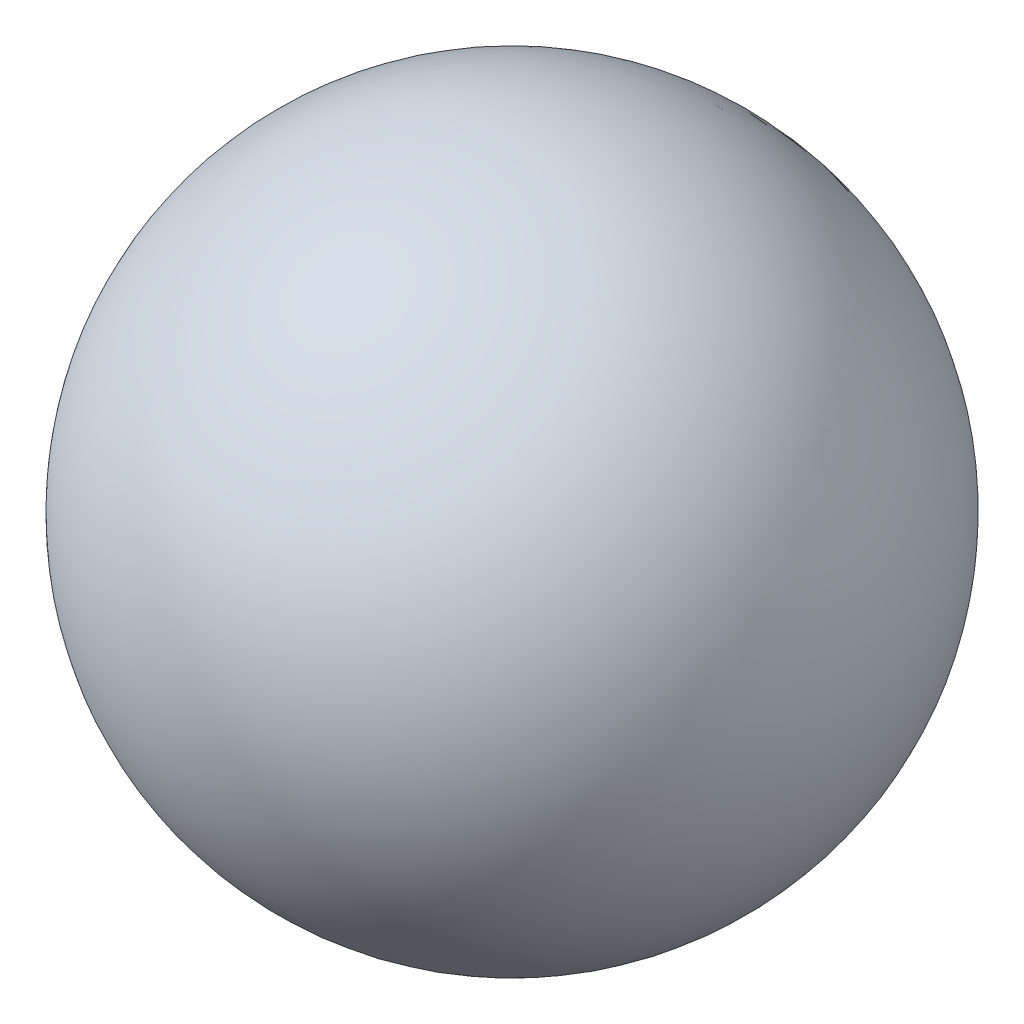
ISO-10303-21;
HEADER;
FILE_DESCRIPTION(('STEP AP214'),'2;1');
FILE_NAME('part.step','',(''),(''),'','','');
FILE_SCHEMA(('AUTOMOTIVE_DESIGN { 1 0 10303 214 1 1 1 1 }'));
ENDSEC;
DATA;
#1=APPLICATION_CONTEXT('core data for automotive mechanical design processes');
#2=APPLICATION_PROTOCOL_DEFINITION('international standard','automotive_design',2000,#1);
#3=PRODUCT_CONTEXT('',#1,'mechanical');
#4=PRODUCT('Part','Part','',(#3));
#5=PRODUCT_RELATED_PRODUCT_CATEGORY('part','',(#4));
#6=PRODUCT_DEFINITION_FORMATION('','',#4);
#7=PRODUCT_DEFINITION_CONTEXT('part definition',#1,'design');
#8=PRODUCT_DEFINITION('design','',#6,#7);
#9=PRODUCT_DEFINITION_SHAPE('','',#8);
#10=(LENGTH_UNIT() NAMED_UNIT(*) SI_UNIT(.MILLI.,.METRE.));
#11=(NAMED_UNIT(*) PLANE_ANGLE_UNIT() SI_UNIT($,.RADIAN.));
#12=(NAMED_UNIT(*) SI_UNIT($,.STERADIAN.) SOLID_ANGLE_UNIT());
#13=UNCERTAINTY_MEASURE_WITH_UNIT(LENGTH_MEASURE(1.E-05),#10,'distance_accuracy_value','');
#14=(GEOMETRIC_REPRESENTATION_CONTEXT(3) GLOBAL_UNCERTAINTY_ASSIGNED_CONTEXT((#13)) GLOBAL_UNIT_ASSIGNED_CONTEXT((#10,
#11,#12)) REPRESENTATION_CONTEXT('',''));
#15=CARTESIAN_POINT('',(0.,0.,0.));
#16=DIRECTION('',(0.,0.,1.));
#17=DIRECTION('',(1.,0.,0.));
#18=AXIS2_PLACEMENT_3D('',#15,#16,#17);
#19=CARTESIAN_POINT('',(64.16,-35.5315924589285,-59.5945184252099));
#20=DIRECTION('',(0.,-0.51210804460644,-0.858921038658026));
#21=DIRECTION('',(0.173648177666934,0.845872098095716,-0.50432797270834));
#22=AXIS2_PLACEMENT_3D('',#19,#20,#21);
#23=SPHERICAL_SURFACE('',#22,7.15);
#24=CARTESIAN_POINT('',(64.16,-31.8700199399924,-53.4532329988051));
#25=VERTEX_POINT('',#24);
#26=VERTEX_LOOP('',#25);
#27=FACE_BOUND('',#26,.T.);
#28=CARTESIAN_POINT('',(64.16,-39.1931649778644,-65.7358038516147));
#29=VERTEX_POINT('',#28);
#30=VERTEX_LOOP('',#29);
#31=FACE_BOUND('',#30,.T.);
#32=ADVANCED_FACE('F15',(#27,#31),#23,.T.);
#33=CLOSED_SHELL('',(#32));
#34=MANIFOLD_SOLID_BREP('B1',#33);
#35=ADVANCED_BREP_SHAPE_REPRESENTATION('',(#18,#34),#14);
#36=SHAPE_DEFINITION_REPRESENTATION(#9,#35);
ENDSEC;
END-ISO-10303-21;
